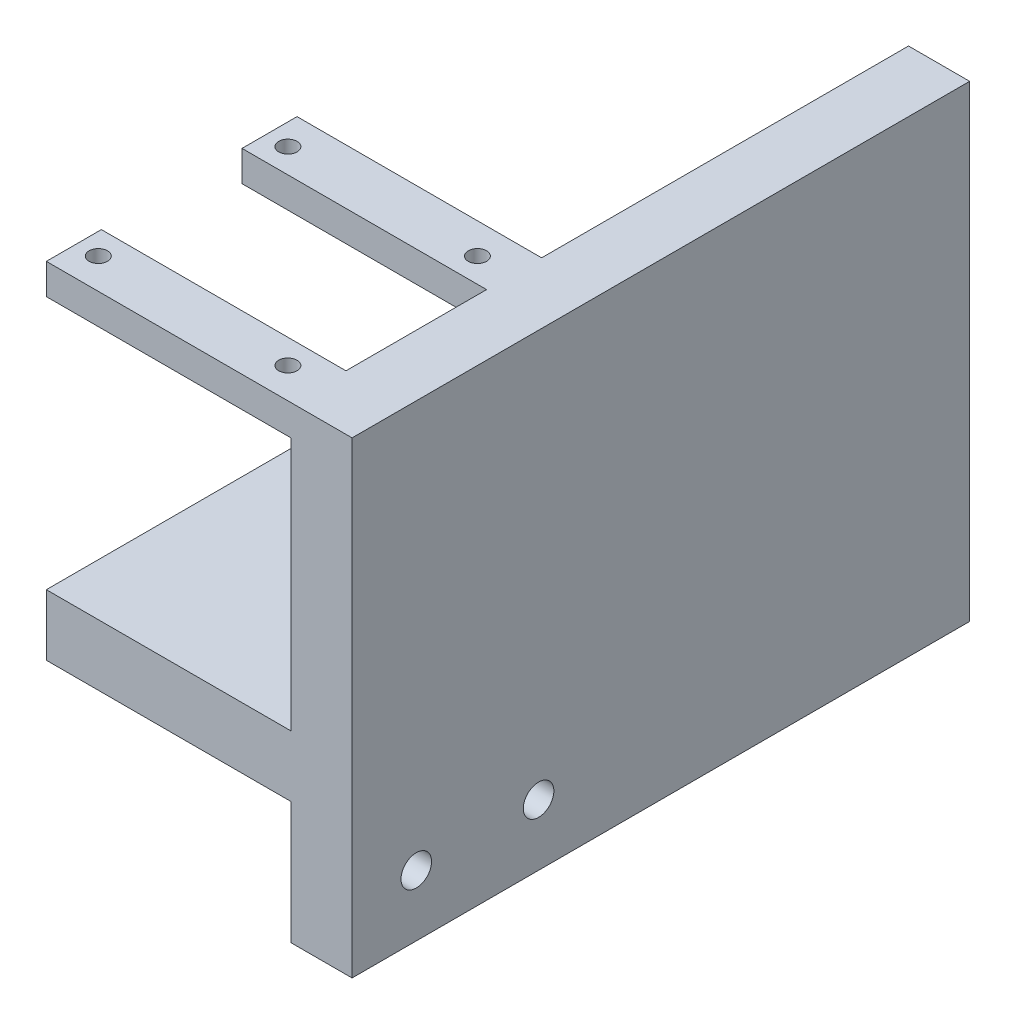
ISO-10303-21;
HEADER;
FILE_DESCRIPTION(('STEP AP214'),'2;1');
FILE_NAME('part.step','',(''),(''),'','','');
FILE_SCHEMA(('AUTOMOTIVE_DESIGN { 1 0 10303 214 1 1 1 1 }'));
ENDSEC;
DATA;
#1=APPLICATION_CONTEXT('core data for automotive mechanical design processes');
#2=APPLICATION_PROTOCOL_DEFINITION('international standard','automotive_design',2000,#1);
#3=PRODUCT_CONTEXT('',#1,'mechanical');
#4=PRODUCT('Part','Part','',(#3));
#5=PRODUCT_RELATED_PRODUCT_CATEGORY('part','',(#4));
#6=PRODUCT_DEFINITION_FORMATION('','',#4);
#7=PRODUCT_DEFINITION_CONTEXT('part definition',#1,'design');
#8=PRODUCT_DEFINITION('design','',#6,#7);
#9=PRODUCT_DEFINITION_SHAPE('','',#8);
#10=(LENGTH_UNIT() NAMED_UNIT(*) SI_UNIT(.MILLI.,.METRE.));
#11=(NAMED_UNIT(*) PLANE_ANGLE_UNIT() SI_UNIT($,.RADIAN.));
#12=(NAMED_UNIT(*) SI_UNIT($,.STERADIAN.) SOLID_ANGLE_UNIT());
#13=UNCERTAINTY_MEASURE_WITH_UNIT(LENGTH_MEASURE(1.E-05),#10,'distance_accuracy_value','');
#14=(GEOMETRIC_REPRESENTATION_CONTEXT(3) GLOBAL_UNCERTAINTY_ASSIGNED_CONTEXT((#13)) GLOBAL_UNIT_ASSIGNED_CONTEXT((#10,
#11,#12)) REPRESENTATION_CONTEXT('',''));
#15=CARTESIAN_POINT('',(0.,0.,0.));
#16=DIRECTION('',(0.,0.,1.));
#17=DIRECTION('',(1.,0.,0.));
#18=AXIS2_PLACEMENT_3D('',#15,#16,#17);
#19=CARTESIAN_POINT('',(10.,0.,-20.5));
#20=DIRECTION('',(0.,0.,-1.));
#21=DIRECTION('',(-1.,0.,0.));
#22=AXIS2_PLACEMENT_3D('',#19,#20,#21);
#23=PLANE('',#22);
#24=DIRECTION('',(-1.,0.,0.));
#25=VECTOR('',#24,1.);
#26=CARTESIAN_POINT('',(10.,56.5,-20.5));
#27=LINE('',#26,#25);
#28=CARTESIAN_POINT('',(0.,56.5,-20.5));
#29=VERTEX_POINT('',#28);
#30=CARTESIAN_POINT('',(-40.,56.5,-20.5));
#31=VERTEX_POINT('',#30);
#32=EDGE_CURVE('E12',#29,#31,#27,.T.);
#33=ORIENTED_EDGE('',*,*,#32,.F.);
#34=DIRECTION('',(0.,-1.,0.));
#35=VECTOR('',#34,1.);
#36=CARTESIAN_POINT('',(0.,0.,-20.5));
#37=LINE('',#36,#35);
#38=CARTESIAN_POINT('',(0.,51.5,-20.5));
#39=VERTEX_POINT('',#38);
#40=EDGE_CURVE('E275',#29,#39,#37,.T.);
#41=ORIENTED_EDGE('',*,*,#40,.T.);
#42=DIRECTION('',(1.,0.,0.));
#43=VECTOR('',#42,1.);
#44=CARTESIAN_POINT('',(-40.,51.5,-20.5));
#45=LINE('',#44,#43);
#46=CARTESIAN_POINT('',(-40.,51.5,-20.5));
#47=VERTEX_POINT('',#46);
#48=EDGE_CURVE('E396',#47,#39,#45,.T.);
#49=ORIENTED_EDGE('',*,*,#48,.F.);
#50=DIRECTION('',(0.,-1.,0.));
#51=VECTOR('',#50,1.);
#52=CARTESIAN_POINT('',(-40.,56.5,-20.5));
#53=LINE('',#52,#51);
#54=EDGE_CURVE('E375',#31,#47,#53,.T.);
#55=ORIENTED_EDGE('',*,*,#54,.F.);
#56=EDGE_LOOP('',(#33,#41,#49,#55));
#57=FACE_BOUND('',#56,.T.);
#58=ADVANCED_FACE('F139',(#57),#23,.T.);
#59=CARTESIAN_POINT('',(0.,0.,0.));
#60=DIRECTION('',(1.,0.,0.));
#61=DIRECTION('',(0.,0.,-1.));
#62=AXIS2_PLACEMENT_3D('',#59,#60,#61);
#63=PLANE('',#62);
#64=CARTESIAN_POINT('',(0.,-10.,-10.));
#65=DIRECTION('',(1.,0.,0.));
#66=DIRECTION('',(0.,0.,-1.));
#67=AXIS2_PLACEMENT_3D('',#64,#65,#66);
#68=CIRCLE('',#67,2.5);
#69=CARTESIAN_POINT('',(0.,-10.,-12.5));
#70=VERTEX_POINT('',#69);
#71=EDGE_CURVE('E452',#70,#70,#68,.T.);
#72=ORIENTED_EDGE('',*,*,#71,.T.);
#73=EDGE_LOOP('',(#72));
#74=FACE_BOUND('',#73,.T.);
#75=CARTESIAN_POINT('',(0.,-10.,10.));
#76=DIRECTION('',(1.,0.,0.));
#77=DIRECTION('',(0.,0.,-1.));
#78=AXIS2_PLACEMENT_3D('',#75,#76,#77);
#79=CIRCLE('',#78,2.5);
#80=CARTESIAN_POINT('',(0.,-10.,7.5));
#81=VERTEX_POINT('',#80);
#82=EDGE_CURVE('E432',#81,#81,#79,.T.);
#83=ORIENTED_EDGE('',*,*,#82,.T.);
#84=EDGE_LOOP('',(#83));
#85=FACE_BOUND('',#84,.T.);
#86=DIRECTION('',(0.,0.,-1.));
#87=VECTOR('',#86,1.);
#88=CARTESIAN_POINT('',(0.,51.5,20.5));
#89=LINE('',#88,#87);
#90=CARTESIAN_POINT('',(0.,51.5,20.5));
#91=VERTEX_POINT('',#90);
#92=CARTESIAN_POINT('',(0.,51.5,11.5));
#93=VERTEX_POINT('',#92);
#94=EDGE_CURVE('E161',#91,#93,#89,.T.);
#95=ORIENTED_EDGE('',*,*,#94,.T.);
#96=DIRECTION('',(0.,1.,0.));
#97=VECTOR('',#96,1.);
#98=CARTESIAN_POINT('',(0.,56.5,11.5));
#99=LINE('',#98,#97);
#100=CARTESIAN_POINT('',(0.,56.5,11.5));
#101=VERTEX_POINT('',#100);
#102=EDGE_CURVE('E336',#93,#101,#99,.T.);
#103=ORIENTED_EDGE('',*,*,#102,.T.);
#104=DIRECTION('',(0.,0.,-1.));
#105=VECTOR('',#104,1.);
#106=CARTESIAN_POINT('',(0.,56.5,0.));
#107=LINE('',#106,#105);
#108=CARTESIAN_POINT('',(0.,56.5,-11.5));
#109=VERTEX_POINT('',#108);
#110=EDGE_CURVE('E445',#101,#109,#107,.T.);
#111=ORIENTED_EDGE('',*,*,#110,.T.);
#112=DIRECTION('',(0.,1.,0.));
#113=VECTOR('',#112,1.);
#114=CARTESIAN_POINT('',(0.,56.5,-11.5));
#115=LINE('',#114,#113);
#116=CARTESIAN_POINT('',(0.,51.5,-11.5));
#117=VERTEX_POINT('',#116);
#118=EDGE_CURVE('E379',#117,#109,#115,.T.);
#119=ORIENTED_EDGE('',*,*,#118,.F.);
#120=DIRECTION('',(0.,0.,1.));
#121=VECTOR('',#120,1.);
#122=CARTESIAN_POINT('',(0.,51.5,-20.5));
#123=LINE('',#122,#121);
#124=EDGE_CURVE('E370',#39,#117,#123,.T.);
#125=ORIENTED_EDGE('',*,*,#124,.F.);
#126=ORIENTED_EDGE('',*,*,#40,.F.);
#127=DIRECTION('',(0.,0.,1.));
#128=VECTOR('',#127,1.);
#129=CARTESIAN_POINT('',(0.,56.5,-80.5));
#130=LINE('',#129,#128);
#131=CARTESIAN_POINT('',(0.,56.5,-80.5));
#132=VERTEX_POINT('',#131);
#133=EDGE_CURVE('E269',#132,#29,#130,.T.);
#134=ORIENTED_EDGE('',*,*,#133,.F.);
#135=DIRECTION('',(0.,-1.,0.));
#136=VECTOR('',#135,1.);
#137=CARTESIAN_POINT('',(0.,0.,-80.5));
#138=LINE('',#137,#136);
#139=CARTESIAN_POINT('',(0.,10.,-80.5));
#140=VERTEX_POINT('',#139);
#141=EDGE_CURVE('E273',#132,#140,#138,.T.);
#142=ORIENTED_EDGE('',*,*,#141,.T.);
#143=DIRECTION('',(0.,0.,1.));
#144=VECTOR('',#143,1.);
#145=CARTESIAN_POINT('',(0.,10.,-80.5));
#146=LINE('',#145,#144);
#147=CARTESIAN_POINT('',(0.,10.,-20.5));
#148=VERTEX_POINT('',#147);
#149=EDGE_CURVE('E316',#140,#148,#146,.T.);
#150=ORIENTED_EDGE('',*,*,#149,.T.);
#151=DIRECTION('',(0.,-1.,0.));
#152=VECTOR('',#151,1.);
#153=CARTESIAN_POINT('',(0.,0.,-20.5));
#154=LINE('',#153,#152);
#155=CARTESIAN_POINT('',(0.,0.,-20.5));
#156=VERTEX_POINT('',#155);
#157=EDGE_CURVE('E429',#148,#156,#154,.T.);
#158=ORIENTED_EDGE('',*,*,#157,.T.);
#159=DIRECTION('',(0.,0.,1.));
#160=VECTOR('',#159,1.);
#161=CARTESIAN_POINT('',(0.,0.,-80.5));
#162=LINE('',#161,#160);
#163=CARTESIAN_POINT('',(0.,0.,-80.5));
#164=VERTEX_POINT('',#163);
#165=EDGE_CURVE('E279',#164,#156,#162,.T.);
#166=ORIENTED_EDGE('',*,*,#165,.F.);
#167=CARTESIAN_POINT('',(0.,-20.,-80.5));
#168=VERTEX_POINT('',#167);
#169=EDGE_CURVE('E298',#164,#168,#138,.T.);
#170=ORIENTED_EDGE('',*,*,#169,.T.);
#171=DIRECTION('',(0.,0.,-1.));
#172=VECTOR('',#171,1.);
#173=CARTESIAN_POINT('',(0.,-20.,0.));
#174=LINE('',#173,#172);
#175=CARTESIAN_POINT('',(0.,-20.,20.5));
#176=VERTEX_POINT('',#175);
#177=EDGE_CURVE('E450',#176,#168,#174,.T.);
#178=ORIENTED_EDGE('',*,*,#177,.F.);
#179=DIRECTION('',(0.,-1.,0.));
#180=VECTOR('',#179,1.);
#181=CARTESIAN_POINT('',(0.,0.,20.5));
#182=LINE('',#181,#180);
#183=CARTESIAN_POINT('',(0.,0.,20.5));
#184=VERTEX_POINT('',#183);
#185=EDGE_CURVE('E447',#184,#176,#182,.T.);
#186=ORIENTED_EDGE('',*,*,#185,.F.);
#187=DIRECTION('',(0.,0.,1.));
#188=VECTOR('',#187,1.);
#189=CARTESIAN_POINT('',(0.,0.,-20.));
#190=LINE('',#189,#188);
#191=CARTESIAN_POINT('',(0.,0.,-20.));
#192=VERTEX_POINT('',#191);
#193=EDGE_CURVE('E404',#192,#184,#190,.T.);
#194=ORIENTED_EDGE('',*,*,#193,.F.);
#195=DIRECTION('',(0.,-1.,0.));
#196=VECTOR('',#195,1.);
#197=CARTESIAN_POINT('',(0.,10.,-20.));
#198=LINE('',#197,#196);
#199=CARTESIAN_POINT('',(0.,10.,-20.));
#200=VERTEX_POINT('',#199);
#201=EDGE_CURVE('E413',#200,#192,#198,.T.);
#202=ORIENTED_EDGE('',*,*,#201,.F.);
#203=DIRECTION('',(0.,0.,-1.));
#204=VECTOR('',#203,1.);
#205=CARTESIAN_POINT('',(0.,10.,-20.));
#206=LINE('',#205,#204);
#207=CARTESIAN_POINT('',(0.,10.,20.5));
#208=VERTEX_POINT('',#207);
#209=EDGE_CURVE('E399',#208,#200,#206,.T.);
#210=ORIENTED_EDGE('',*,*,#209,.F.);
#211=EDGE_CURVE('E448',#91,#208,#182,.T.);
#212=ORIENTED_EDGE('',*,*,#211,.F.);
#213=EDGE_LOOP('',(#95,#103,#111,#119,#125,#126,#134,#142,#150,#158,#166,#170,#178,#186,#194,
#202,#210,#212));
#214=FACE_BOUND('',#213,.T.);
#215=ADVANCED_FACE('F271',(#74,#85,#214),#63,.F.);
#216=CARTESIAN_POINT('',(10.,56.5,0.));
#217=DIRECTION('',(0.,1.,0.));
#218=DIRECTION('',(0.,0.,1.));
#219=AXIS2_PLACEMENT_3D('',#216,#217,#218);
#220=PLANE('',#219);
#221=CARTESIAN_POINT('',(-36.5,56.5,15.5));
#222=DIRECTION('',(0.,-1.,0.));
#223=DIRECTION('',(0.,0.,-1.));
#224=AXIS2_PLACEMENT_3D('',#221,#222,#223);
#225=CIRCLE('',#224,1.5);
#226=CARTESIAN_POINT('',(-36.5,56.5,14.));
#227=VERTEX_POINT('',#226);
#228=EDGE_CURVE('E329',#227,#227,#225,.T.);
#229=ORIENTED_EDGE('',*,*,#228,.T.);
#230=EDGE_LOOP('',(#229));
#231=FACE_BOUND('',#230,.T.);
#232=CARTESIAN_POINT('',(-5.5,56.5,15.5));
#233=DIRECTION('',(0.,-1.,0.));
#234=DIRECTION('',(0.,0.,-1.));
#235=AXIS2_PLACEMENT_3D('',#232,#233,#234);
#236=CIRCLE('',#235,1.5);
#237=CARTESIAN_POINT('',(-5.5,56.5,14.));
#238=VERTEX_POINT('',#237);
#239=EDGE_CURVE('E278',#238,#238,#236,.T.);
#240=ORIENTED_EDGE('',*,*,#239,.T.);
#241=EDGE_LOOP('',(#240));
#242=FACE_BOUND('',#241,.T.);
#243=CARTESIAN_POINT('',(-36.5,56.5,-15.5));
#244=DIRECTION('',(0.,1.,0.));
#245=DIRECTION('',(0.,0.,1.));
#246=AXIS2_PLACEMENT_3D('',#243,#244,#245);
#247=CIRCLE('',#246,1.5);
#248=CARTESIAN_POINT('',(-36.5,56.5,-14.));
#249=VERTEX_POINT('',#248);
#250=EDGE_CURVE('E366',#249,#249,#247,.T.);
#251=ORIENTED_EDGE('',*,*,#250,.F.);
#252=EDGE_LOOP('',(#251));
#253=FACE_BOUND('',#252,.T.);
#254=CARTESIAN_POINT('',(-5.5,56.5,-15.5));
#255=DIRECTION('',(0.,1.,0.));
#256=DIRECTION('',(0.,0.,1.));
#257=AXIS2_PLACEMENT_3D('',#254,#255,#256);
#258=CIRCLE('',#257,1.5);
#259=CARTESIAN_POINT('',(-5.5,56.5,-14.));
#260=VERTEX_POINT('',#259);
#261=EDGE_CURVE('E362',#260,#260,#258,.T.);
#262=ORIENTED_EDGE('',*,*,#261,.F.);
#263=EDGE_LOOP('',(#262));
#264=FACE_BOUND('',#263,.T.);
#265=ORIENTED_EDGE('',*,*,#110,.F.);
#266=DIRECTION('',(1.,0.,0.));
#267=VECTOR('',#266,1.);
#268=CARTESIAN_POINT('',(-40.,56.5,11.5));
#269=LINE('',#268,#267);
#270=CARTESIAN_POINT('',(-40.,56.5,11.5));
#271=VERTEX_POINT('',#270);
#272=EDGE_CURVE('E360',#271,#101,#269,.T.);
#273=ORIENTED_EDGE('',*,*,#272,.F.);
#274=DIRECTION('',(0.,0.,1.));
#275=VECTOR('',#274,1.);
#276=CARTESIAN_POINT('',(-40.,56.5,20.5));
#277=LINE('',#276,#275);
#278=CARTESIAN_POINT('',(-40.,56.5,20.5));
#279=VERTEX_POINT('',#278);
#280=EDGE_CURVE('E344',#271,#279,#277,.T.);
#281=ORIENTED_EDGE('',*,*,#280,.T.);
#282=DIRECTION('',(-1.,0.,0.));
#283=VECTOR('',#282,1.);
#284=CARTESIAN_POINT('',(10.,56.5,20.5));
#285=LINE('',#284,#283);
#286=CARTESIAN_POINT('',(10.,56.5,20.5));
#287=VERTEX_POINT('',#286);
#288=EDGE_CURVE('E146',#287,#279,#285,.T.);
#289=ORIENTED_EDGE('',*,*,#288,.F.);
#290=DIRECTION('',(0.,0.,-1.));
#291=VECTOR('',#290,1.);
#292=CARTESIAN_POINT('',(10.,56.5,0.));
#293=LINE('',#292,#291);
#294=CARTESIAN_POINT('',(10.,56.5,-80.5));
#295=VERTEX_POINT('',#294);
#296=EDGE_CURVE('E286',#287,#295,#293,.T.);
#297=ORIENTED_EDGE('',*,*,#296,.T.);
#298=DIRECTION('',(1.,0.,0.));
#299=VECTOR('',#298,1.);
#300=CARTESIAN_POINT('',(0.,56.5,-80.5));
#301=LINE('',#300,#299);
#302=EDGE_CURVE('E282',#132,#295,#301,.T.);
#303=ORIENTED_EDGE('',*,*,#302,.F.);
#304=ORIENTED_EDGE('',*,*,#133,.T.);
#305=ORIENTED_EDGE('',*,*,#32,.T.);
#306=DIRECTION('',(0.,0.,-1.));
#307=VECTOR('',#306,1.);
#308=CARTESIAN_POINT('',(-40.,56.5,-20.5));
#309=LINE('',#308,#307);
#310=CARTESIAN_POINT('',(-40.,56.5,-11.5));
#311=VERTEX_POINT('',#310);
#312=EDGE_CURVE('E383',#311,#31,#309,.T.);
#313=ORIENTED_EDGE('',*,*,#312,.F.);
#314=DIRECTION('',(1.,0.,0.));
#315=VECTOR('',#314,1.);
#316=CARTESIAN_POINT('',(-40.,56.5,-11.5));
#317=LINE('',#316,#315);
#318=EDGE_CURVE('E386',#311,#109,#317,.T.);
#319=ORIENTED_EDGE('',*,*,#318,.T.);
#320=EDGE_LOOP('',(#265,#273,#281,#289,#297,#303,#304,#305,#313,#319));
#321=FACE_BOUND('',#320,.T.);
#322=ADVANCED_FACE('F284',(#231,#242,#253,#264,#321),#220,.T.);
#323=CARTESIAN_POINT('',(10.,0.,20.5));
#324=DIRECTION('',(0.,0.,-1.));
#325=DIRECTION('',(-1.,0.,0.));
#326=AXIS2_PLACEMENT_3D('',#323,#324,#325);
#327=PLANE('',#326);
#328=ORIENTED_EDGE('',*,*,#288,.T.);
#329=DIRECTION('',(0.,-1.,0.));
#330=VECTOR('',#329,1.);
#331=CARTESIAN_POINT('',(-40.,56.5,20.5));
#332=LINE('',#331,#330);
#333=CARTESIAN_POINT('',(-40.,51.5,20.5));
#334=VERTEX_POINT('',#333);
#335=EDGE_CURVE('E341',#279,#334,#332,.T.);
#336=ORIENTED_EDGE('',*,*,#335,.T.);
#337=DIRECTION('',(1.,0.,0.));
#338=VECTOR('',#337,1.);
#339=CARTESIAN_POINT('',(-40.,51.5,20.5));
#340=LINE('',#339,#338);
#341=EDGE_CURVE('E353',#334,#91,#340,.T.);
#342=ORIENTED_EDGE('',*,*,#341,.T.);
#343=ORIENTED_EDGE('',*,*,#211,.T.);
#344=DIRECTION('',(1.,0.,0.));
#345=VECTOR('',#344,1.);
#346=CARTESIAN_POINT('',(-40.,10.,20.5));
#347=LINE('',#346,#345);
#348=CARTESIAN_POINT('',(-40.,10.,20.5));
#349=VERTEX_POINT('',#348);
#350=EDGE_CURVE('E426',#349,#208,#347,.T.);
#351=ORIENTED_EDGE('',*,*,#350,.F.);
#352=DIRECTION('',(0.,1.,0.));
#353=VECTOR('',#352,1.);
#354=CARTESIAN_POINT('',(-40.,10.,20.5));
#355=LINE('',#354,#353);
#356=CARTESIAN_POINT('',(-40.,0.,20.5));
#357=VERTEX_POINT('',#356);
#358=EDGE_CURVE('E400',#357,#349,#355,.T.);
#359=ORIENTED_EDGE('',*,*,#358,.F.);
#360=DIRECTION('',(1.,0.,0.));
#361=VECTOR('',#360,1.);
#362=CARTESIAN_POINT('',(-40.,0.,20.5));
#363=LINE('',#362,#361);
#364=EDGE_CURVE('E410',#357,#184,#363,.T.);
#365=ORIENTED_EDGE('',*,*,#364,.T.);
#366=ORIENTED_EDGE('',*,*,#185,.T.);
#367=DIRECTION('',(-1.,0.,0.));
#368=VECTOR('',#367,1.);
#369=CARTESIAN_POINT('',(10.,-20.,20.5));
#370=LINE('',#369,#368);
#371=CARTESIAN_POINT('',(10.,-20.,20.5));
#372=VERTEX_POINT('',#371);
#373=EDGE_CURVE('E442',#372,#176,#370,.T.);
#374=ORIENTED_EDGE('',*,*,#373,.F.);
#375=DIRECTION('',(0.,-1.,0.));
#376=VECTOR('',#375,1.);
#377=CARTESIAN_POINT('',(10.,0.,20.5));
#378=LINE('',#377,#376);
#379=EDGE_CURVE('E431',#287,#372,#378,.T.);
#380=ORIENTED_EDGE('',*,*,#379,.F.);
#381=EDGE_LOOP('',(#328,#336,#342,#343,#351,#359,#365,#366,#374,#380));
#382=FACE_BOUND('',#381,.T.);
#383=ADVANCED_FACE('F461',(#382),#327,.F.);
#384=CARTESIAN_POINT('',(10.,-10.,-10.));
#385=DIRECTION('',(-1.,0.,0.));
#386=DIRECTION('',(0.,0.,1.));
#387=AXIS2_PLACEMENT_3D('',#384,#385,#386);
#388=CYLINDRICAL_SURFACE('',#387,2.5);
#389=CARTESIAN_POINT('',(10.,-10.,-10.));
#390=DIRECTION('',(1.,0.,0.));
#391=DIRECTION('',(0.,0.,-1.));
#392=AXIS2_PLACEMENT_3D('',#389,#390,#391);
#393=CIRCLE('',#392,2.5);
#394=CARTESIAN_POINT('',(10.,-10.,-12.5));
#395=VERTEX_POINT('',#394);
#396=EDGE_CURVE('E436',#395,#395,#393,.T.);
#397=ORIENTED_EDGE('',*,*,#396,.T.);
#398=EDGE_LOOP('',(#397));
#399=FACE_BOUND('',#398,.T.);
#400=ORIENTED_EDGE('',*,*,#71,.F.);
#401=EDGE_LOOP('',(#400));
#402=FACE_BOUND('',#401,.T.);
#403=ADVANCED_FACE('F544',(#399,#402),#388,.F.);
#404=CARTESIAN_POINT('',(10.,-20.,0.));
#405=DIRECTION('',(0.,1.,0.));
#406=DIRECTION('',(0.,0.,1.));
#407=AXIS2_PLACEMENT_3D('',#404,#405,#406);
#408=PLANE('',#407);
#409=ORIENTED_EDGE('',*,*,#177,.T.);
#410=DIRECTION('',(-1.,0.,0.));
#411=VECTOR('',#410,1.);
#412=CARTESIAN_POINT('',(0.,-20.,-80.5));
#413=LINE('',#412,#411);
#414=CARTESIAN_POINT('',(10.,-20.,-80.5));
#415=VERTEX_POINT('',#414);
#416=EDGE_CURVE('E303',#415,#168,#413,.T.);
#417=ORIENTED_EDGE('',*,*,#416,.F.);
#418=DIRECTION('',(0.,0.,-1.));
#419=VECTOR('',#418,1.);
#420=CARTESIAN_POINT('',(10.,-20.,0.));
#421=LINE('',#420,#419);
#422=EDGE_CURVE('E434',#372,#415,#421,.T.);
#423=ORIENTED_EDGE('',*,*,#422,.F.);
#424=ORIENTED_EDGE('',*,*,#373,.T.);
#425=EDGE_LOOP('',(#409,#417,#423,#424));
#426=FACE_BOUND('',#425,.T.);
#427=ADVANCED_FACE('F542',(#426),#408,.F.);
#428=CARTESIAN_POINT('',(10.,-10.,10.));
#429=DIRECTION('',(-1.,0.,0.));
#430=DIRECTION('',(0.,0.,1.));
#431=AXIS2_PLACEMENT_3D('',#428,#429,#430);
#432=CYLINDRICAL_SURFACE('',#431,2.5);
#433=CARTESIAN_POINT('',(10.,-10.,10.));
#434=DIRECTION('',(1.,0.,0.));
#435=DIRECTION('',(0.,0.,-1.));
#436=AXIS2_PLACEMENT_3D('',#433,#434,#435);
#437=CIRCLE('',#436,2.5);
#438=CARTESIAN_POINT('',(10.,-10.,7.5));
#439=VERTEX_POINT('',#438);
#440=EDGE_CURVE('E439',#439,#439,#437,.T.);
#441=ORIENTED_EDGE('',*,*,#440,.T.);
#442=EDGE_LOOP('',(#441));
#443=FACE_BOUND('',#442,.T.);
#444=ORIENTED_EDGE('',*,*,#82,.F.);
#445=EDGE_LOOP('',(#444));
#446=FACE_BOUND('',#445,.T.);
#447=ADVANCED_FACE('F537',(#443,#446),#432,.F.);
#448=CARTESIAN_POINT('',(10.,0.,0.));
#449=DIRECTION('',(1.,0.,0.));
#450=DIRECTION('',(0.,0.,-1.));
#451=AXIS2_PLACEMENT_3D('',#448,#449,#450);
#452=PLANE('',#451);
#453=ORIENTED_EDGE('',*,*,#422,.T.);
#454=DIRECTION('',(0.,-1.,0.));
#455=VECTOR('',#454,1.);
#456=CARTESIAN_POINT('',(10.,0.,-80.5));
#457=LINE('',#456,#455);
#458=EDGE_CURVE('E290',#295,#415,#457,.T.);
#459=ORIENTED_EDGE('',*,*,#458,.F.);
#460=ORIENTED_EDGE('',*,*,#296,.F.);
#461=ORIENTED_EDGE('',*,*,#379,.T.);
#462=EDGE_LOOP('',(#453,#459,#460,#461));
#463=FACE_BOUND('',#462,.T.);
#464=ORIENTED_EDGE('',*,*,#396,.F.);
#465=EDGE_LOOP('',(#464));
#466=FACE_BOUND('',#465,.T.);
#467=ORIENTED_EDGE('',*,*,#440,.F.);
#468=EDGE_LOOP('',(#467));
#469=FACE_BOUND('',#468,.T.);
#470=ADVANCED_FACE('F534',(#463,#466,#469),#452,.T.);
#471=CARTESIAN_POINT('',(-40.,10.,-20.));
#472=DIRECTION('',(0.,-1.,0.));
#473=DIRECTION('',(0.,0.,-1.));
#474=AXIS2_PLACEMENT_3D('',#471,#472,#473);
#475=PLANE('',#474);
#476=ORIENTED_EDGE('',*,*,#209,.T.);
#477=DIRECTION('',(1.,0.,0.));
#478=VECTOR('',#477,1.);
#479=CARTESIAN_POINT('',(-40.,10.,-20.));
#480=LINE('',#479,#478);
#481=CARTESIAN_POINT('',(-40.,10.,-20.));
#482=VERTEX_POINT('',#481);
#483=EDGE_CURVE('E423',#482,#200,#480,.T.);
#484=ORIENTED_EDGE('',*,*,#483,.F.);
#485=DIRECTION('',(0.,0.,-1.));
#486=VECTOR('',#485,1.);
#487=CARTESIAN_POINT('',(-40.,10.,-20.));
#488=LINE('',#487,#486);
#489=EDGE_CURVE('E403',#349,#482,#488,.T.);
#490=ORIENTED_EDGE('',*,*,#489,.F.);
#491=ORIENTED_EDGE('',*,*,#350,.T.);
#492=EDGE_LOOP('',(#476,#484,#490,#491));
#493=FACE_BOUND('',#492,.T.);
#494=ADVANCED_FACE('F530',(#493),#475,.F.);
#495=CARTESIAN_POINT('',(-40.,10.,-20.));
#496=DIRECTION('',(0.,0.,1.));
#497=DIRECTION('',(1.,0.,0.));
#498=AXIS2_PLACEMENT_3D('',#495,#496,#497);
#499=PLANE('',#498);
#500=ORIENTED_EDGE('',*,*,#201,.T.);
#501=DIRECTION('',(1.,0.,0.));
#502=VECTOR('',#501,1.);
#503=CARTESIAN_POINT('',(-40.,0.,-20.));
#504=LINE('',#503,#502);
#505=CARTESIAN_POINT('',(-40.,0.,-20.));
#506=VERTEX_POINT('',#505);
#507=EDGE_CURVE('E420',#506,#192,#504,.T.);
#508=ORIENTED_EDGE('',*,*,#507,.F.);
#509=DIRECTION('',(0.,-1.,0.));
#510=VECTOR('',#509,1.);
#511=CARTESIAN_POINT('',(-40.,10.,-20.));
#512=LINE('',#511,#510);
#513=EDGE_CURVE('E406',#482,#506,#512,.T.);
#514=ORIENTED_EDGE('',*,*,#513,.F.);
#515=ORIENTED_EDGE('',*,*,#483,.T.);
#516=EDGE_LOOP('',(#500,#508,#514,#515));
#517=FACE_BOUND('',#516,.T.);
#518=ADVANCED_FACE('F526',(#517),#499,.F.);
#519=CARTESIAN_POINT('',(-40.,0.,-20.));
#520=DIRECTION('',(0.,1.,0.));
#521=DIRECTION('',(0.,0.,1.));
#522=AXIS2_PLACEMENT_3D('',#519,#520,#521);
#523=PLANE('',#522);
#524=ORIENTED_EDGE('',*,*,#193,.T.);
#525=ORIENTED_EDGE('',*,*,#364,.F.);
#526=DIRECTION('',(0.,0.,1.));
#527=VECTOR('',#526,1.);
#528=CARTESIAN_POINT('',(-40.,0.,-20.));
#529=LINE('',#528,#527);
#530=EDGE_CURVE('E408',#506,#357,#529,.T.);
#531=ORIENTED_EDGE('',*,*,#530,.F.);
#532=ORIENTED_EDGE('',*,*,#507,.T.);
#533=EDGE_LOOP('',(#524,#525,#531,#532));
#534=FACE_BOUND('',#533,.T.);
#535=ADVANCED_FACE('F517',(#534),#523,.F.);
#536=CARTESIAN_POINT('',(-40.,0.,0.));
#537=DIRECTION('',(-1.,0.,0.));
#538=DIRECTION('',(0.,0.,1.));
#539=AXIS2_PLACEMENT_3D('',#536,#537,#538);
#540=PLANE('',#539);
#541=ORIENTED_EDGE('',*,*,#358,.T.);
#542=ORIENTED_EDGE('',*,*,#489,.T.);
#543=ORIENTED_EDGE('',*,*,#513,.T.);
#544=ORIENTED_EDGE('',*,*,#530,.T.);
#545=EDGE_LOOP('',(#541,#542,#543,#544));
#546=FACE_BOUND('',#545,.T.);
#547=ADVANCED_FACE('F509',(#546),#540,.T.);
#548=CARTESIAN_POINT('',(-40.,51.5,-20.5));
#549=DIRECTION('',(0.,1.,0.));
#550=DIRECTION('',(0.,0.,1.));
#551=AXIS2_PLACEMENT_3D('',#548,#549,#550);
#552=PLANE('',#551);
#553=CARTESIAN_POINT('',(-36.5,51.5,-15.5));
#554=DIRECTION('',(0.,1.,0.));
#555=DIRECTION('',(0.,0.,1.));
#556=AXIS2_PLACEMENT_3D('',#553,#554,#555);
#557=CIRCLE('',#556,1.5);
#558=CARTESIAN_POINT('',(-36.5,51.5,-14.));
#559=VERTEX_POINT('',#558);
#560=EDGE_CURVE('E363',#559,#559,#557,.F.);
#561=ORIENTED_EDGE('',*,*,#560,.F.);
#562=EDGE_LOOP('',(#561));
#563=FACE_BOUND('',#562,.T.);
#564=CARTESIAN_POINT('',(-5.5,51.5,-15.5));
#565=DIRECTION('',(0.,1.,0.));
#566=DIRECTION('',(0.,0.,1.));
#567=AXIS2_PLACEMENT_3D('',#564,#565,#566);
#568=CIRCLE('',#567,1.5);
#569=CARTESIAN_POINT('',(-5.5,51.5,-14.));
#570=VERTEX_POINT('',#569);
#571=EDGE_CURVE('E367',#570,#570,#568,.F.);
#572=ORIENTED_EDGE('',*,*,#571,.F.);
#573=EDGE_LOOP('',(#572));
#574=FACE_BOUND('',#573,.T.);
#575=ORIENTED_EDGE('',*,*,#124,.T.);
#576=DIRECTION('',(1.,0.,0.));
#577=VECTOR('',#576,1.);
#578=CARTESIAN_POINT('',(-40.,51.5,-11.5));
#579=LINE('',#578,#577);
#580=CARTESIAN_POINT('',(-40.,51.5,-11.5));
#581=VERTEX_POINT('',#580);
#582=EDGE_CURVE('E393',#581,#117,#579,.T.);
#583=ORIENTED_EDGE('',*,*,#582,.F.);
#584=DIRECTION('',(0.,0.,1.));
#585=VECTOR('',#584,1.);
#586=CARTESIAN_POINT('',(-40.,51.5,-20.5));
#587=LINE('',#586,#585);
#588=EDGE_CURVE('E378',#47,#581,#587,.T.);
#589=ORIENTED_EDGE('',*,*,#588,.F.);
#590=ORIENTED_EDGE('',*,*,#48,.T.);
#591=EDGE_LOOP('',(#575,#583,#589,#590));
#592=FACE_BOUND('',#591,.T.);
#593=ADVANCED_FACE('F507',(#563,#574,#592),#552,.F.);
#594=CARTESIAN_POINT('',(-40.,56.5,-11.5));
#595=DIRECTION('',(0.,0.,-1.));
#596=DIRECTION('',(-1.,0.,0.));
#597=AXIS2_PLACEMENT_3D('',#594,#595,#596);
#598=PLANE('',#597);
#599=ORIENTED_EDGE('',*,*,#118,.T.);
#600=ORIENTED_EDGE('',*,*,#318,.F.);
#601=DIRECTION('',(0.,1.,0.));
#602=VECTOR('',#601,1.);
#603=CARTESIAN_POINT('',(-40.,56.5,-11.5));
#604=LINE('',#603,#602);
#605=EDGE_CURVE('E381',#581,#311,#604,.T.);
#606=ORIENTED_EDGE('',*,*,#605,.F.);
#607=ORIENTED_EDGE('',*,*,#582,.T.);
#608=EDGE_LOOP('',(#599,#600,#606,#607));
#609=FACE_BOUND('',#608,.T.);
#610=ADVANCED_FACE('F505',(#609),#598,.F.);
#611=CARTESIAN_POINT('',(-40.,0.,0.));
#612=DIRECTION('',(-1.,0.,0.));
#613=DIRECTION('',(0.,0.,1.));
#614=AXIS2_PLACEMENT_3D('',#611,#612,#613);
#615=PLANE('',#614);
#616=ORIENTED_EDGE('',*,*,#54,.T.);
#617=ORIENTED_EDGE('',*,*,#588,.T.);
#618=ORIENTED_EDGE('',*,*,#605,.T.);
#619=ORIENTED_EDGE('',*,*,#312,.T.);
#620=EDGE_LOOP('',(#616,#617,#618,#619));
#621=FACE_BOUND('',#620,.T.);
#622=ADVANCED_FACE('F500',(#621),#615,.T.);
#623=CARTESIAN_POINT('',(-5.5,-20.001,-15.5));
#624=DIRECTION('',(0.,1.,0.));
#625=DIRECTION('',(0.,0.,1.));
#626=AXIS2_PLACEMENT_3D('',#623,#624,#625);
#627=CYLINDRICAL_SURFACE('',#626,1.5);
#628=ORIENTED_EDGE('',*,*,#261,.T.);
#629=EDGE_LOOP('',(#628));
#630=FACE_BOUND('',#629,.T.);
#631=ORIENTED_EDGE('',*,*,#571,.T.);
#632=EDGE_LOOP('',(#631));
#633=FACE_BOUND('',#632,.T.);
#634=ADVANCED_FACE('F564',(#630,#633),#627,.F.);
#635=CARTESIAN_POINT('',(-36.5,-20.001,-15.5));
#636=DIRECTION('',(0.,1.,0.));
#637=DIRECTION('',(0.,0.,1.));
#638=AXIS2_PLACEMENT_3D('',#635,#636,#637);
#639=CYLINDRICAL_SURFACE('',#638,1.5);
#640=ORIENTED_EDGE('',*,*,#250,.T.);
#641=EDGE_LOOP('',(#640));
#642=FACE_BOUND('',#641,.T.);
#643=ORIENTED_EDGE('',*,*,#560,.T.);
#644=EDGE_LOOP('',(#643));
#645=FACE_BOUND('',#644,.T.);
#646=ADVANCED_FACE('F485',(#642,#645),#639,.F.);
#647=CARTESIAN_POINT('',(-40.,56.5,11.5));
#648=DIRECTION('',(0.,0.,-1.));
#649=DIRECTION('',(-1.,0.,0.));
#650=AXIS2_PLACEMENT_3D('',#647,#648,#649);
#651=PLANE('',#650);
#652=ORIENTED_EDGE('',*,*,#102,.F.);
#653=DIRECTION('',(1.,0.,0.));
#654=VECTOR('',#653,1.);
#655=CARTESIAN_POINT('',(-40.,51.5,11.5));
#656=LINE('',#655,#654);
#657=CARTESIAN_POINT('',(-40.,51.5,11.5));
#658=VERTEX_POINT('',#657);
#659=EDGE_CURVE('E358',#658,#93,#656,.T.);
#660=ORIENTED_EDGE('',*,*,#659,.F.);
#661=DIRECTION('',(0.,1.,0.));
#662=VECTOR('',#661,1.);
#663=CARTESIAN_POINT('',(-40.,56.5,11.5));
#664=LINE('',#663,#662);
#665=EDGE_CURVE('E347',#658,#271,#664,.T.);
#666=ORIENTED_EDGE('',*,*,#665,.T.);
#667=ORIENTED_EDGE('',*,*,#272,.T.);
#668=EDGE_LOOP('',(#652,#660,#666,#667));
#669=FACE_BOUND('',#668,.T.);
#670=ADVANCED_FACE('F470',(#669),#651,.T.);
#671=CARTESIAN_POINT('',(-40.,51.5,20.5));
#672=DIRECTION('',(0.,-1.,0.));
#673=DIRECTION('',(0.,0.,-1.));
#674=AXIS2_PLACEMENT_3D('',#671,#672,#673);
#675=PLANE('',#674);
#676=CARTESIAN_POINT('',(-36.5,51.5,15.5));
#677=DIRECTION('',(0.,-1.,0.));
#678=DIRECTION('',(0.,0.,-1.));
#679=AXIS2_PLACEMENT_3D('',#676,#677,#678);
#680=CIRCLE('',#679,1.5);
#681=CARTESIAN_POINT('',(-36.5,51.5,14.));
#682=VERTEX_POINT('',#681);
#683=EDGE_CURVE('E332',#682,#682,#680,.T.);
#684=ORIENTED_EDGE('',*,*,#683,.F.);
#685=EDGE_LOOP('',(#684));
#686=FACE_BOUND('',#685,.T.);
#687=CARTESIAN_POINT('',(-5.5,51.5,15.5));
#688=DIRECTION('',(0.,-1.,0.));
#689=DIRECTION('',(0.,0.,-1.));
#690=AXIS2_PLACEMENT_3D('',#687,#688,#689);
#691=CIRCLE('',#690,1.5);
#692=CARTESIAN_POINT('',(-5.5,51.5,14.));
#693=VERTEX_POINT('',#692);
#694=EDGE_CURVE('E333',#693,#693,#691,.T.);
#695=ORIENTED_EDGE('',*,*,#694,.F.);
#696=EDGE_LOOP('',(#695));
#697=FACE_BOUND('',#696,.T.);
#698=ORIENTED_EDGE('',*,*,#94,.F.);
#699=ORIENTED_EDGE('',*,*,#341,.F.);
#700=DIRECTION('',(0.,0.,-1.));
#701=VECTOR('',#700,1.);
#702=CARTESIAN_POINT('',(-40.,51.5,20.5));
#703=LINE('',#702,#701);
#704=EDGE_CURVE('E350',#334,#658,#703,.T.);
#705=ORIENTED_EDGE('',*,*,#704,.T.);
#706=ORIENTED_EDGE('',*,*,#659,.T.);
#707=EDGE_LOOP('',(#698,#699,#705,#706));
#708=FACE_BOUND('',#707,.T.);
#709=ADVANCED_FACE('F475',(#686,#697,#708),#675,.T.);
#710=CARTESIAN_POINT('',(-40.,0.,0.));
#711=DIRECTION('',(-1.,0.,0.));
#712=DIRECTION('',(0.,0.,-1.));
#713=AXIS2_PLACEMENT_3D('',#710,#711,#712);
#714=PLANE('',#713);
#715=ORIENTED_EDGE('',*,*,#335,.F.);
#716=ORIENTED_EDGE('',*,*,#280,.F.);
#717=ORIENTED_EDGE('',*,*,#665,.F.);
#718=ORIENTED_EDGE('',*,*,#704,.F.);
#719=EDGE_LOOP('',(#715,#716,#717,#718));
#720=FACE_BOUND('',#719,.T.);
#721=ADVANCED_FACE('F466',(#720),#714,.T.);
#722=CARTESIAN_POINT('',(-5.5,-20.001,15.5));
#723=DIRECTION('',(0.,1.,0.));
#724=DIRECTION('',(0.,0.,1.));
#725=AXIS2_PLACEMENT_3D('',#722,#723,#724);
#726=CYLINDRICAL_SURFACE('',#725,1.5);
#727=ORIENTED_EDGE('',*,*,#694,.T.);
#728=EDGE_LOOP('',(#727));
#729=FACE_BOUND('',#728,.T.);
#730=ORIENTED_EDGE('',*,*,#239,.F.);
#731=EDGE_LOOP('',(#730));
#732=FACE_BOUND('',#731,.T.);
#733=ADVANCED_FACE('F483',(#729,#732),#726,.F.);
#734=CARTESIAN_POINT('',(-36.5,-20.001,15.5));
#735=DIRECTION('',(0.,1.,0.));
#736=DIRECTION('',(0.,0.,1.));
#737=AXIS2_PLACEMENT_3D('',#734,#735,#736);
#738=CYLINDRICAL_SURFACE('',#737,1.5);
#739=ORIENTED_EDGE('',*,*,#683,.T.);
#740=EDGE_LOOP('',(#739));
#741=FACE_BOUND('',#740,.T.);
#742=ORIENTED_EDGE('',*,*,#228,.F.);
#743=EDGE_LOOP('',(#742));
#744=FACE_BOUND('',#743,.T.);
#745=ADVANCED_FACE('F667',(#741,#744),#738,.F.);
#746=CARTESIAN_POINT('',(0.,0.,-80.5));
#747=DIRECTION('',(0.,-1.,0.));
#748=DIRECTION('',(0.,0.,-1.));
#749=AXIS2_PLACEMENT_3D('',#746,#747,#748);
#750=PLANE('',#749);
#751=DIRECTION('',(1.,0.,0.));
#752=VECTOR('',#751,1.);
#753=CARTESIAN_POINT('',(0.,0.,-20.5));
#754=LINE('',#753,#752);
#755=CARTESIAN_POINT('',(-40.,0.,-20.5));
#756=VERTEX_POINT('',#755);
#757=EDGE_CURVE('E318',#756,#156,#754,.T.);
#758=ORIENTED_EDGE('',*,*,#757,.F.);
#759=DIRECTION('',(0.,0.,1.));
#760=VECTOR('',#759,1.);
#761=CARTESIAN_POINT('',(-40.,0.,-80.5));
#762=LINE('',#761,#760);
#763=CARTESIAN_POINT('',(-40.,0.,-80.5));
#764=VERTEX_POINT('',#763);
#765=EDGE_CURVE('E326',#764,#756,#762,.T.);
#766=ORIENTED_EDGE('',*,*,#765,.F.);
#767=DIRECTION('',(1.,0.,0.));
#768=VECTOR('',#767,1.);
#769=CARTESIAN_POINT('',(0.,0.,-80.5));
#770=LINE('',#769,#768);
#771=EDGE_CURVE('E302',#764,#164,#770,.T.);
#772=ORIENTED_EDGE('',*,*,#771,.T.);
#773=ORIENTED_EDGE('',*,*,#165,.T.);
#774=EDGE_LOOP('',(#758,#766,#772,#773));
#775=FACE_BOUND('',#774,.T.);
#776=ADVANCED_FACE('F661',(#775),#750,.T.);
#777=CARTESIAN_POINT('',(0.,10.,-80.5));
#778=DIRECTION('',(0.,-1.,0.));
#779=DIRECTION('',(0.,0.,-1.));
#780=AXIS2_PLACEMENT_3D('',#777,#778,#779);
#781=PLANE('',#780);
#782=DIRECTION('',(1.,0.,0.));
#783=VECTOR('',#782,1.);
#784=CARTESIAN_POINT('',(0.,10.,-20.5));
#785=LINE('',#784,#783);
#786=CARTESIAN_POINT('',(-40.,10.,-20.5));
#787=VERTEX_POINT('',#786);
#788=EDGE_CURVE('E153',#787,#148,#785,.T.);
#789=ORIENTED_EDGE('',*,*,#788,.T.);
#790=ORIENTED_EDGE('',*,*,#149,.F.);
#791=DIRECTION('',(1.,0.,0.));
#792=VECTOR('',#791,1.);
#793=CARTESIAN_POINT('',(0.,10.,-80.5));
#794=LINE('',#793,#792);
#795=CARTESIAN_POINT('',(-40.,10.,-80.5));
#796=VERTEX_POINT('',#795);
#797=EDGE_CURVE('E296',#796,#140,#794,.T.);
#798=ORIENTED_EDGE('',*,*,#797,.F.);
#799=DIRECTION('',(0.,0.,1.));
#800=VECTOR('',#799,1.);
#801=CARTESIAN_POINT('',(-40.,10.,-80.5));
#802=LINE('',#801,#800);
#803=EDGE_CURVE('E324',#796,#787,#802,.T.);
#804=ORIENTED_EDGE('',*,*,#803,.T.);
#805=EDGE_LOOP('',(#789,#790,#798,#804));
#806=FACE_BOUND('',#805,.T.);
#807=ADVANCED_FACE('F666',(#806),#781,.F.);
#808=CARTESIAN_POINT('',(0.,0.,-20.5));
#809=DIRECTION('',(0.,0.,-1.));
#810=DIRECTION('',(-1.,0.,0.));
#811=AXIS2_PLACEMENT_3D('',#808,#809,#810);
#812=PLANE('',#811);
#813=ORIENTED_EDGE('',*,*,#157,.F.);
#814=ORIENTED_EDGE('',*,*,#788,.F.);
#815=DIRECTION('',(0.,-1.,0.));
#816=VECTOR('',#815,1.);
#817=CARTESIAN_POINT('',(-40.,0.,-20.5));
#818=LINE('',#817,#816);
#819=EDGE_CURVE('E299',#787,#756,#818,.T.);
#820=ORIENTED_EDGE('',*,*,#819,.T.);
#821=ORIENTED_EDGE('',*,*,#757,.T.);
#822=EDGE_LOOP('',(#813,#814,#820,#821));
#823=FACE_BOUND('',#822,.T.);
#824=ADVANCED_FACE('F679',(#823),#812,.F.);
#825=CARTESIAN_POINT('',(-40.,0.,-80.5));
#826=DIRECTION('',(-1.,0.,0.));
#827=DIRECTION('',(0.,0.,1.));
#828=AXIS2_PLACEMENT_3D('',#825,#826,#827);
#829=PLANE('',#828);
#830=ORIENTED_EDGE('',*,*,#819,.F.);
#831=ORIENTED_EDGE('',*,*,#803,.F.);
#832=DIRECTION('',(0.,-1.,0.));
#833=VECTOR('',#832,1.);
#834=CARTESIAN_POINT('',(-40.,0.,-80.5));
#835=LINE('',#834,#833);
#836=EDGE_CURVE('E306',#796,#764,#835,.T.);
#837=ORIENTED_EDGE('',*,*,#836,.T.);
#838=ORIENTED_EDGE('',*,*,#765,.T.);
#839=EDGE_LOOP('',(#830,#831,#837,#838));
#840=FACE_BOUND('',#839,.T.);
#841=ADVANCED_FACE('F689',(#840),#829,.T.);
#842=CARTESIAN_POINT('',(0.,0.,-80.5));
#843=DIRECTION('',(0.,0.,-1.));
#844=DIRECTION('',(-1.,0.,0.));
#845=AXIS2_PLACEMENT_3D('',#842,#843,#844);
#846=PLANE('',#845);
#847=ORIENTED_EDGE('',*,*,#169,.F.);
#848=ORIENTED_EDGE('',*,*,#771,.F.);
#849=ORIENTED_EDGE('',*,*,#836,.F.);
#850=ORIENTED_EDGE('',*,*,#797,.T.);
#851=ORIENTED_EDGE('',*,*,#141,.F.);
#852=ORIENTED_EDGE('',*,*,#302,.T.);
#853=ORIENTED_EDGE('',*,*,#458,.T.);
#854=ORIENTED_EDGE('',*,*,#416,.T.);
#855=EDGE_LOOP('',(#847,#848,#849,#850,#851,#852,#853,#854));
#856=FACE_BOUND('',#855,.T.);
#857=ADVANCED_FACE('F293',(#856),#846,.T.);
#858=CLOSED_SHELL('',(#58,#215,#322,#383,#403,#427,#447,#470,#494,#518,#535,#547,#593,#610,#622,
#634,#646,#670,#709,#721,#733,#745,#776,#807,#824,#841,#857));
#859=MANIFOLD_SOLID_BREP('B2',#858);
#860=ADVANCED_BREP_SHAPE_REPRESENTATION('',(#18,#859),#14);
#861=SHAPE_DEFINITION_REPRESENTATION(#9,#860);
ENDSEC;
END-ISO-10303-21;
